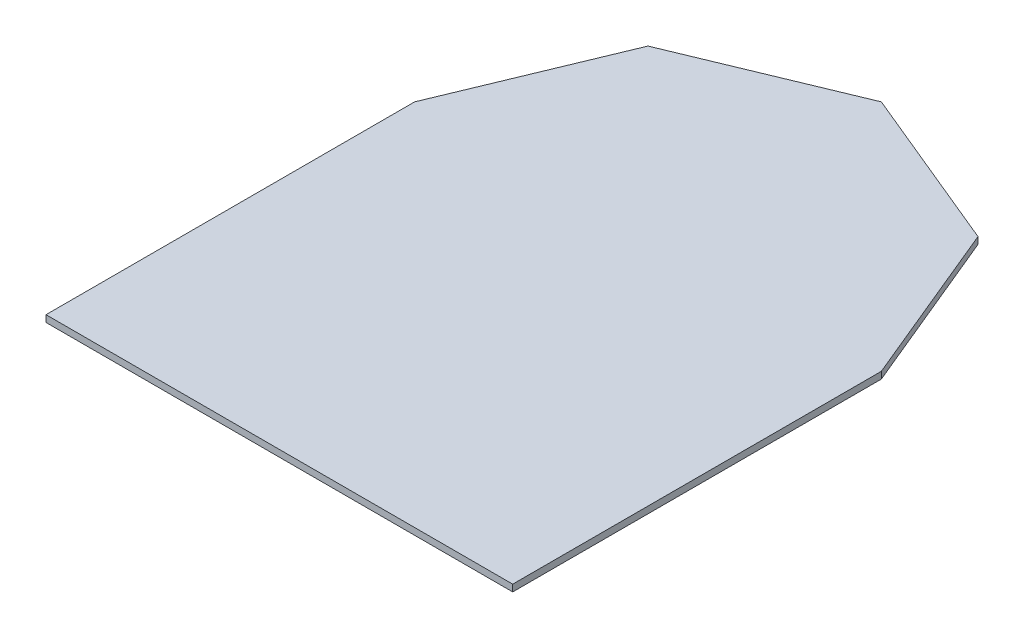
ISO-10303-21;
HEADER;
FILE_DESCRIPTION(('STEP AP214'),'2;1');
FILE_NAME('part.step','',(''),(''),'','','');
FILE_SCHEMA(('AUTOMOTIVE_DESIGN { 1 0 10303 214 1 1 1 1 }'));
ENDSEC;
DATA;
#1=APPLICATION_CONTEXT('core data for automotive mechanical design processes');
#2=APPLICATION_PROTOCOL_DEFINITION('international standard','automotive_design',2000,#1);
#3=PRODUCT_CONTEXT('',#1,'mechanical');
#4=PRODUCT('Part','Part','',(#3));
#5=PRODUCT_RELATED_PRODUCT_CATEGORY('part','',(#4));
#6=PRODUCT_DEFINITION_FORMATION('','',#4);
#7=PRODUCT_DEFINITION_CONTEXT('part definition',#1,'design');
#8=PRODUCT_DEFINITION('design','',#6,#7);
#9=PRODUCT_DEFINITION_SHAPE('','',#8);
#10=(LENGTH_UNIT() NAMED_UNIT(*) SI_UNIT(.MILLI.,.METRE.));
#11=(NAMED_UNIT(*) PLANE_ANGLE_UNIT() SI_UNIT($,.RADIAN.));
#12=(NAMED_UNIT(*) SI_UNIT($,.STERADIAN.) SOLID_ANGLE_UNIT());
#13=UNCERTAINTY_MEASURE_WITH_UNIT(LENGTH_MEASURE(1.E-05),#10,'distance_accuracy_value','');
#14=(GEOMETRIC_REPRESENTATION_CONTEXT(3) GLOBAL_UNCERTAINTY_ASSIGNED_CONTEXT((#13)) GLOBAL_UNIT_ASSIGNED_CONTEXT((#10,
#11,#12)) REPRESENTATION_CONTEXT('',''));
#15=CARTESIAN_POINT('',(0.,0.,0.));
#16=DIRECTION('',(0.,0.,1.));
#17=DIRECTION('',(1.,0.,0.));
#18=AXIS2_PLACEMENT_3D('',#15,#16,#17);
#19=CARTESIAN_POINT('',(0.,2.5,0.));
#20=DIRECTION('',(1.,0.,0.));
#21=DIRECTION('',(0.,0.,-1.));
#22=AXIS2_PLACEMENT_3D('',#19,#20,#21);
#23=PLANE('',#22);
#24=DIRECTION('',(0.,0.,1.));
#25=VECTOR('',#24,1.);
#26=CARTESIAN_POINT('',(0.,0.,0.));
#27=LINE('',#26,#25);
#28=CARTESIAN_POINT('',(0.,0.,-136.25));
#29=VERTEX_POINT('',#28);
#30=CARTESIAN_POINT('',(0.,0.,0.));
#31=VERTEX_POINT('',#30);
#32=EDGE_CURVE('E125',#29,#31,#27,.T.);
#33=ORIENTED_EDGE('',*,*,#32,.T.);
#34=DIRECTION('',(0.,-1.,0.));
#35=VECTOR('',#34,1.);
#36=CARTESIAN_POINT('',(0.,2.5,0.));
#37=LINE('',#36,#35);
#38=CARTESIAN_POINT('',(0.,2.5,0.));
#39=VERTEX_POINT('',#38);
#40=EDGE_CURVE('E11',#39,#31,#37,.T.);
#41=ORIENTED_EDGE('',*,*,#40,.F.);
#42=DIRECTION('',(0.,0.,1.));
#43=VECTOR('',#42,1.);
#44=CARTESIAN_POINT('',(0.,2.5,0.));
#45=LINE('',#44,#43);
#46=CARTESIAN_POINT('',(0.,2.5,-136.25));
#47=VERTEX_POINT('',#46);
#48=EDGE_CURVE('E137',#47,#39,#45,.T.);
#49=ORIENTED_EDGE('',*,*,#48,.F.);
#50=DIRECTION('',(0.,-1.,0.));
#51=VECTOR('',#50,1.);
#52=CARTESIAN_POINT('',(0.,2.5,-136.25));
#53=LINE('',#52,#51);
#54=EDGE_CURVE('E121',#47,#29,#53,.T.);
#55=ORIENTED_EDGE('',*,*,#54,.T.);
#56=EDGE_LOOP('',(#33,#41,#49,#55));
#57=FACE_BOUND('',#56,.T.);
#58=ADVANCED_FACE('F35',(#57),#23,.F.);
#59=CARTESIAN_POINT('',(0.,2.5,0.));
#60=DIRECTION('',(0.,0.,-1.));
#61=DIRECTION('',(-1.,0.,0.));
#62=AXIS2_PLACEMENT_3D('',#59,#60,#61);
#63=PLANE('',#62);
#64=DIRECTION('',(1.,0.,0.));
#65=VECTOR('',#64,1.);
#66=CARTESIAN_POINT('',(0.,0.,0.));
#67=LINE('',#66,#65);
#68=CARTESIAN_POINT('',(172.5,0.,0.));
#69=VERTEX_POINT('',#68);
#70=EDGE_CURVE('E128',#31,#69,#67,.T.);
#71=ORIENTED_EDGE('',*,*,#70,.T.);
#72=DIRECTION('',(0.,-1.,0.));
#73=VECTOR('',#72,1.);
#74=CARTESIAN_POINT('',(172.5,2.5,0.));
#75=LINE('',#74,#73);
#76=CARTESIAN_POINT('',(172.5,2.5,0.));
#77=VERTEX_POINT('',#76);
#78=EDGE_CURVE('E43',#77,#69,#75,.T.);
#79=ORIENTED_EDGE('',*,*,#78,.F.);
#80=DIRECTION('',(1.,0.,0.));
#81=VECTOR('',#80,1.);
#82=CARTESIAN_POINT('',(0.,2.5,0.));
#83=LINE('',#82,#81);
#84=EDGE_CURVE('E91',#39,#77,#83,.T.);
#85=ORIENTED_EDGE('',*,*,#84,.F.);
#86=ORIENTED_EDGE('',*,*,#40,.T.);
#87=EDGE_LOOP('',(#71,#79,#85,#86));
#88=FACE_BOUND('',#87,.T.);
#89=ADVANCED_FACE('F162',(#88),#63,.F.);
#90=CARTESIAN_POINT('',(172.5,2.5,0.));
#91=DIRECTION('',(-1.,0.,0.));
#92=DIRECTION('',(0.,0.,1.));
#93=AXIS2_PLACEMENT_3D('',#90,#91,#92);
#94=PLANE('',#93);
#95=DIRECTION('',(0.,0.,-1.));
#96=VECTOR('',#95,1.);
#97=CARTESIAN_POINT('',(172.5,0.,0.));
#98=LINE('',#97,#96);
#99=CARTESIAN_POINT('',(172.5,0.,-136.25));
#100=VERTEX_POINT('',#99);
#101=EDGE_CURVE('E130',#69,#100,#98,.T.);
#102=ORIENTED_EDGE('',*,*,#101,.T.);
#103=DIRECTION('',(0.,-1.,0.));
#104=VECTOR('',#103,1.);
#105=CARTESIAN_POINT('',(172.5,2.5,-136.25));
#106=LINE('',#105,#104);
#107=CARTESIAN_POINT('',(172.5,2.5,-136.25));
#108=VERTEX_POINT('',#107);
#109=EDGE_CURVE('E141',#108,#100,#106,.T.);
#110=ORIENTED_EDGE('',*,*,#109,.F.);
#111=DIRECTION('',(0.,0.,-1.));
#112=VECTOR('',#111,1.);
#113=CARTESIAN_POINT('',(172.5,2.5,0.));
#114=LINE('',#113,#112);
#115=EDGE_CURVE('E149',#77,#108,#114,.T.);
#116=ORIENTED_EDGE('',*,*,#115,.F.);
#117=ORIENTED_EDGE('',*,*,#78,.T.);
#118=EDGE_LOOP('',(#102,#110,#116,#117));
#119=FACE_BOUND('',#118,.T.);
#120=ADVANCED_FACE('F147',(#119),#94,.F.);
#121=CARTESIAN_POINT('',(172.5,2.5,-136.25));
#122=DIRECTION('',(-0.923879532511287,0.,0.38268343236509));
#123=DIRECTION('',(0.38268343236509,0.,0.923879532511287));
#124=AXIS2_PLACEMENT_3D('',#121,#122,#123);
#125=PLANE('',#124);
#126=DIRECTION('',(-0.38268343236509,0.,-0.923879532511287));
#127=VECTOR('',#126,1.);
#128=CARTESIAN_POINT('',(172.5,0.,-136.25));
#129=LINE('',#128,#127);
#130=CARTESIAN_POINT('',(147.23795987734,0.,-197.23795987734));
#131=VERTEX_POINT('',#130);
#132=EDGE_CURVE('E132',#100,#131,#129,.T.);
#133=ORIENTED_EDGE('',*,*,#132,.T.);
#134=DIRECTION('',(0.,-1.,0.));
#135=VECTOR('',#134,1.);
#136=CARTESIAN_POINT('',(147.23795987734,2.5,-197.23795987734));
#137=LINE('',#136,#135);
#138=CARTESIAN_POINT('',(147.23795987734,2.5,-197.23795987734));
#139=VERTEX_POINT('',#138);
#140=EDGE_CURVE('E116',#139,#131,#137,.T.);
#141=ORIENTED_EDGE('',*,*,#140,.F.);
#142=DIRECTION('',(-0.38268343236509,0.,-0.923879532511287));
#143=VECTOR('',#142,1.);
#144=CARTESIAN_POINT('',(172.5,2.5,-136.25));
#145=LINE('',#144,#143);
#146=EDGE_CURVE('E107',#108,#139,#145,.T.);
#147=ORIENTED_EDGE('',*,*,#146,.F.);
#148=ORIENTED_EDGE('',*,*,#109,.T.);
#149=EDGE_LOOP('',(#133,#141,#147,#148));
#150=FACE_BOUND('',#149,.T.);
#151=ADVANCED_FACE('F155',(#150),#125,.F.);
#152=CARTESIAN_POINT('',(147.23795987734,2.5,-197.23795987734));
#153=DIRECTION('',(-0.38268343236509,0.,0.923879532511287));
#154=DIRECTION('',(0.923879532511287,0.,0.38268343236509));
#155=AXIS2_PLACEMENT_3D('',#152,#153,#154);
#156=PLANE('',#155);
#157=DIRECTION('',(-0.923879532511287,0.,-0.38268343236509));
#158=VECTOR('',#157,1.);
#159=CARTESIAN_POINT('',(147.23795987734,0.,-197.23795987734));
#160=LINE('',#159,#158);
#161=CARTESIAN_POINT('',(86.25,0.,-222.5));
#162=VERTEX_POINT('',#161);
#163=EDGE_CURVE('E115',#131,#162,#160,.T.);
#164=ORIENTED_EDGE('',*,*,#163,.T.);
#165=DIRECTION('',(0.,-1.,0.));
#166=VECTOR('',#165,1.);
#167=CARTESIAN_POINT('',(86.25,2.5,-222.5));
#168=LINE('',#167,#166);
#169=CARTESIAN_POINT('',(86.25,2.5,-222.5));
#170=VERTEX_POINT('',#169);
#171=EDGE_CURVE('E112',#170,#162,#168,.T.);
#172=ORIENTED_EDGE('',*,*,#171,.F.);
#173=DIRECTION('',(-0.923879532511287,0.,-0.38268343236509));
#174=VECTOR('',#173,1.);
#175=CARTESIAN_POINT('',(147.23795987734,2.5,-197.23795987734));
#176=LINE('',#175,#174);
#177=EDGE_CURVE('E101',#139,#170,#176,.T.);
#178=ORIENTED_EDGE('',*,*,#177,.F.);
#179=ORIENTED_EDGE('',*,*,#140,.T.);
#180=EDGE_LOOP('',(#164,#172,#178,#179));
#181=FACE_BOUND('',#180,.T.);
#182=ADVANCED_FACE('F113',(#181),#156,.F.);
#183=CARTESIAN_POINT('',(86.25,2.5,-222.5));
#184=DIRECTION('',(0.382683432365089,0.,0.923879532511287));
#185=DIRECTION('',(0.923879532511287,0.,-0.382683432365089));
#186=AXIS2_PLACEMENT_3D('',#183,#184,#185);
#187=PLANE('',#186);
#188=DIRECTION('',(-0.923879532511287,0.,0.382683432365089));
#189=VECTOR('',#188,1.);
#190=CARTESIAN_POINT('',(86.25,0.,-222.5));
#191=LINE('',#190,#189);
#192=CARTESIAN_POINT('',(25.2620401226603,0.,-197.23795987734));
#193=VERTEX_POINT('',#192);
#194=EDGE_CURVE('E77',#162,#193,#191,.T.);
#195=ORIENTED_EDGE('',*,*,#194,.T.);
#196=DIRECTION('',(0.,-1.,0.));
#197=VECTOR('',#196,1.);
#198=CARTESIAN_POINT('',(25.2620401226603,2.5,-197.23795987734));
#199=LINE('',#198,#197);
#200=CARTESIAN_POINT('',(25.2620401226603,2.5,-197.23795987734));
#201=VERTEX_POINT('',#200);
#202=EDGE_CURVE('E117',#201,#193,#199,.T.);
#203=ORIENTED_EDGE('',*,*,#202,.F.);
#204=DIRECTION('',(-0.923879532511287,0.,0.382683432365089));
#205=VECTOR('',#204,1.);
#206=CARTESIAN_POINT('',(86.25,2.5,-222.5));
#207=LINE('',#206,#205);
#208=EDGE_CURVE('E105',#170,#201,#207,.T.);
#209=ORIENTED_EDGE('',*,*,#208,.F.);
#210=ORIENTED_EDGE('',*,*,#171,.T.);
#211=EDGE_LOOP('',(#195,#203,#209,#210));
#212=FACE_BOUND('',#211,.T.);
#213=ADVANCED_FACE('F119',(#212),#187,.F.);
#214=CARTESIAN_POINT('',(25.2620401226603,2.5,-197.23795987734));
#215=DIRECTION('',(0.923879532511287,0.,0.38268343236509));
#216=DIRECTION('',(0.38268343236509,0.,-0.923879532511287));
#217=AXIS2_PLACEMENT_3D('',#214,#215,#216);
#218=PLANE('',#217);
#219=DIRECTION('',(-0.38268343236509,0.,0.923879532511287));
#220=VECTOR('',#219,1.);
#221=CARTESIAN_POINT('',(25.2620401226603,0.,-197.23795987734));
#222=LINE('',#221,#220);
#223=EDGE_CURVE('E83',#193,#29,#222,.T.);
#224=ORIENTED_EDGE('',*,*,#223,.T.);
#225=ORIENTED_EDGE('',*,*,#54,.F.);
#226=DIRECTION('',(-0.38268343236509,0.,0.923879532511287));
#227=VECTOR('',#226,1.);
#228=CARTESIAN_POINT('',(25.2620401226603,2.5,-197.23795987734));
#229=LINE('',#228,#227);
#230=EDGE_CURVE('E51',#201,#47,#229,.T.);
#231=ORIENTED_EDGE('',*,*,#230,.F.);
#232=ORIENTED_EDGE('',*,*,#202,.T.);
#233=EDGE_LOOP('',(#224,#225,#231,#232));
#234=FACE_BOUND('',#233,.T.);
#235=ADVANCED_FACE('F176',(#234),#218,.F.);
#236=CARTESIAN_POINT('',(0.,2.5,0.));
#237=DIRECTION('',(0.,-1.,0.));
#238=DIRECTION('',(0.,0.,-1.));
#239=AXIS2_PLACEMENT_3D('',#236,#237,#238);
#240=PLANE('',#239);
#241=ORIENTED_EDGE('',*,*,#48,.T.);
#242=ORIENTED_EDGE('',*,*,#84,.T.);
#243=ORIENTED_EDGE('',*,*,#115,.T.);
#244=ORIENTED_EDGE('',*,*,#146,.T.);
#245=ORIENTED_EDGE('',*,*,#177,.T.);
#246=ORIENTED_EDGE('',*,*,#208,.T.);
#247=ORIENTED_EDGE('',*,*,#230,.T.);
#248=EDGE_LOOP('',(#241,#242,#243,#244,#245,#246,#247));
#249=FACE_BOUND('',#248,.T.);
#250=ADVANCED_FACE('F103',(#249),#240,.F.);
#251=CARTESIAN_POINT('',(0.,0.,0.));
#252=DIRECTION('',(0.,-1.,0.));
#253=DIRECTION('',(0.,0.,-1.));
#254=AXIS2_PLACEMENT_3D('',#251,#252,#253);
#255=PLANE('',#254);
#256=ORIENTED_EDGE('',*,*,#32,.F.);
#257=ORIENTED_EDGE('',*,*,#223,.F.);
#258=ORIENTED_EDGE('',*,*,#194,.F.);
#259=ORIENTED_EDGE('',*,*,#163,.F.);
#260=ORIENTED_EDGE('',*,*,#132,.F.);
#261=ORIENTED_EDGE('',*,*,#101,.F.);
#262=ORIENTED_EDGE('',*,*,#70,.F.);
#263=EDGE_LOOP('',(#256,#257,#258,#259,#260,#261,#262));
#264=FACE_BOUND('',#263,.T.);
#265=ADVANCED_FACE('F153',(#264),#255,.T.);
#266=CLOSED_SHELL('',(#58,#89,#120,#151,#182,#213,#235,#250,#265));
#267=MANIFOLD_SOLID_BREP('B2',#266);
#268=ADVANCED_BREP_SHAPE_REPRESENTATION('',(#18,#267),#14);
#269=SHAPE_DEFINITION_REPRESENTATION(#9,#268);
ENDSEC;
END-ISO-10303-21;
